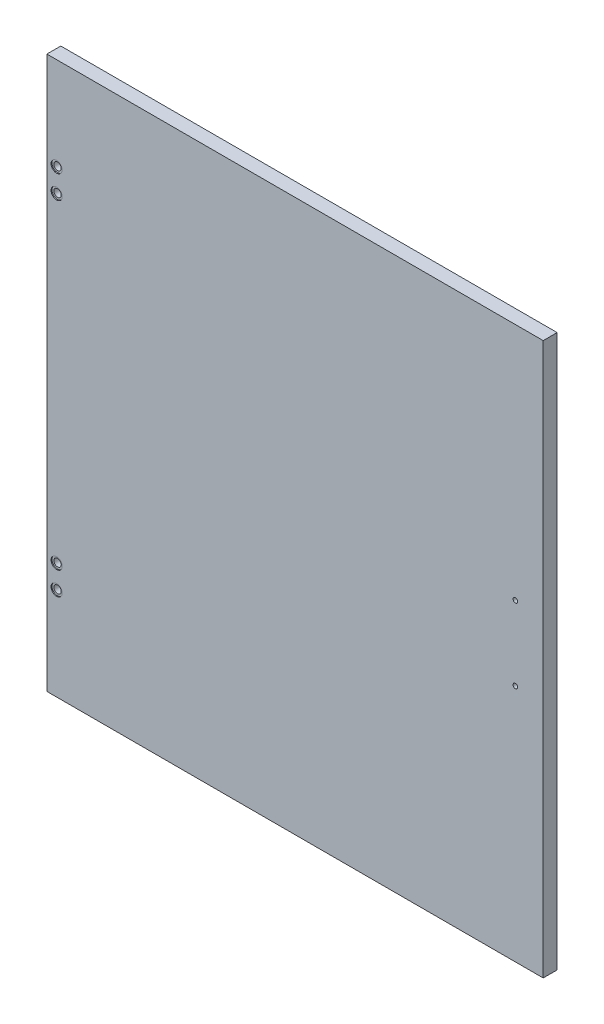
ISO-10303-21;
HEADER;
FILE_DESCRIPTION(('STEP AP214'),'2;1');
FILE_NAME('part.step','',(''),(''),'','','');
FILE_SCHEMA(('AUTOMOTIVE_DESIGN { 1 0 10303 214 1 1 1 1 }'));
ENDSEC;
DATA;
#1=APPLICATION_CONTEXT('core data for automotive mechanical design processes');
#2=APPLICATION_PROTOCOL_DEFINITION('international standard','automotive_design',2000,#1);
#3=PRODUCT_CONTEXT('',#1,'mechanical');
#4=PRODUCT('Part','Part','',(#3));
#5=PRODUCT_RELATED_PRODUCT_CATEGORY('part','',(#4));
#6=PRODUCT_DEFINITION_FORMATION('','',#4);
#7=PRODUCT_DEFINITION_CONTEXT('part definition',#1,'design');
#8=PRODUCT_DEFINITION('design','',#6,#7);
#9=PRODUCT_DEFINITION_SHAPE('','',#8);
#10=(LENGTH_UNIT() NAMED_UNIT(*) SI_UNIT(.MILLI.,.METRE.));
#11=(NAMED_UNIT(*) PLANE_ANGLE_UNIT() SI_UNIT($,.RADIAN.));
#12=(NAMED_UNIT(*) SI_UNIT($,.STERADIAN.) SOLID_ANGLE_UNIT());
#13=UNCERTAINTY_MEASURE_WITH_UNIT(LENGTH_MEASURE(1.E-05),#10,'distance_accuracy_value','');
#14=(GEOMETRIC_REPRESENTATION_CONTEXT(3) GLOBAL_UNCERTAINTY_ASSIGNED_CONTEXT((#13)) GLOBAL_UNIT_ASSIGNED_CONTEXT((#10,
#11,#12)) REPRESENTATION_CONTEXT('',''));
#15=CARTESIAN_POINT('',(0.,0.,0.));
#16=DIRECTION('',(0.,0.,1.));
#17=DIRECTION('',(1.,0.,0.));
#18=AXIS2_PLACEMENT_3D('',#15,#16,#17);
#19=CARTESIAN_POINT('',(-257.,-172.5,0.));
#20=DIRECTION('',(0.,0.,1.));
#21=DIRECTION('',(1.,0.,0.));
#22=AXIS2_PLACEMENT_3D('',#19,#20,#21);
#23=CYLINDRICAL_SURFACE('',#22,3.99999999999999);
#24=CARTESIAN_POINT('',(-257.,-172.5,0.));
#25=DIRECTION('',(0.,0.,-1.));
#26=DIRECTION('',(1.,0.,0.));
#27=AXIS2_PLACEMENT_3D('',#24,#25,#26);
#28=CIRCLE('',#27,3.99999999999999);
#29=CARTESIAN_POINT('',(-253.,-172.5,0.));
#30=VERTEX_POINT('',#29);
#31=EDGE_CURVE('E118',#30,#30,#28,.T.);
#32=ORIENTED_EDGE('',*,*,#31,.T.);
#33=EDGE_LOOP('',(#32));
#34=FACE_BOUND('',#33,.T.);
#35=CARTESIAN_POINT('',(-257.,-172.5,14.));
#36=DIRECTION('',(0.,0.,1.));
#37=DIRECTION('',(1.,0.,0.));
#38=AXIS2_PLACEMENT_3D('',#35,#36,#37);
#39=CIRCLE('',#38,3.99999999999999);
#40=CARTESIAN_POINT('',(-253.,-172.5,14.));
#41=VERTEX_POINT('',#40);
#42=EDGE_CURVE('E40',#41,#41,#39,.T.);
#43=ORIENTED_EDGE('',*,*,#42,.T.);
#44=EDGE_LOOP('',(#43));
#45=FACE_BOUND('',#44,.T.);
#46=ADVANCED_FACE('F36',(#34,#45),#23,.F.);
#47=CARTESIAN_POINT('',(-257.,-197.5,0.));
#48=DIRECTION('',(0.,0.,1.));
#49=DIRECTION('',(1.,0.,0.));
#50=AXIS2_PLACEMENT_3D('',#47,#48,#49);
#51=CYLINDRICAL_SURFACE('',#50,3.99999999999999);
#52=CARTESIAN_POINT('',(-257.,-197.5,0.));
#53=DIRECTION('',(0.,0.,-1.));
#54=DIRECTION('',(1.,0.,0.));
#55=AXIS2_PLACEMENT_3D('',#52,#53,#54);
#56=CIRCLE('',#55,3.99999999999999);
#57=CARTESIAN_POINT('',(-253.,-197.5,0.));
#58=VERTEX_POINT('',#57);
#59=EDGE_CURVE('E154',#58,#58,#56,.T.);
#60=ORIENTED_EDGE('',*,*,#59,.T.);
#61=EDGE_LOOP('',(#60));
#62=FACE_BOUND('',#61,.T.);
#63=CARTESIAN_POINT('',(-257.,-197.5,14.));
#64=DIRECTION('',(0.,0.,1.));
#65=DIRECTION('',(1.,0.,0.));
#66=AXIS2_PLACEMENT_3D('',#63,#64,#65);
#67=CIRCLE('',#66,3.99999999999999);
#68=CARTESIAN_POINT('',(-253.,-197.5,14.));
#69=VERTEX_POINT('',#68);
#70=EDGE_CURVE('E119',#69,#69,#67,.T.);
#71=ORIENTED_EDGE('',*,*,#70,.T.);
#72=EDGE_LOOP('',(#71));
#73=FACE_BOUND('',#72,.T.);
#74=ADVANCED_FACE('F172',(#62,#73),#51,.F.);
#75=CARTESIAN_POINT('',(-257.,172.5,0.));
#76=DIRECTION('',(0.,0.,1.));
#77=DIRECTION('',(1.,0.,0.));
#78=AXIS2_PLACEMENT_3D('',#75,#76,#77);
#79=CYLINDRICAL_SURFACE('',#78,3.99999999999999);
#80=CARTESIAN_POINT('',(-257.,172.5,0.));
#81=DIRECTION('',(0.,0.,1.));
#82=DIRECTION('',(1.,0.,0.));
#83=AXIS2_PLACEMENT_3D('',#80,#81,#82);
#84=CIRCLE('',#83,3.99999999999999);
#85=CARTESIAN_POINT('',(-253.,172.5,0.));
#86=VERTEX_POINT('',#85);
#87=EDGE_CURVE('E157',#86,#86,#84,.T.);
#88=ORIENTED_EDGE('',*,*,#87,.F.);
#89=EDGE_LOOP('',(#88));
#90=FACE_BOUND('',#89,.T.);
#91=CARTESIAN_POINT('',(-257.,172.5,14.));
#92=DIRECTION('',(0.,0.,1.));
#93=DIRECTION('',(1.,0.,0.));
#94=AXIS2_PLACEMENT_3D('',#91,#92,#93);
#95=CIRCLE('',#94,3.99999999999999);
#96=CARTESIAN_POINT('',(-253.,172.5,14.));
#97=VERTEX_POINT('',#96);
#98=EDGE_CURVE('E115',#97,#97,#95,.F.);
#99=ORIENTED_EDGE('',*,*,#98,.F.);
#100=EDGE_LOOP('',(#99));
#101=FACE_BOUND('',#100,.T.);
#102=ADVANCED_FACE('F168',(#90,#101),#79,.F.);
#103=CARTESIAN_POINT('',(-257.,197.5,0.));
#104=DIRECTION('',(0.,0.,1.));
#105=DIRECTION('',(1.,0.,0.));
#106=AXIS2_PLACEMENT_3D('',#103,#104,#105);
#107=CYLINDRICAL_SURFACE('',#106,3.99999999999999);
#108=CARTESIAN_POINT('',(-257.,197.5,0.));
#109=DIRECTION('',(0.,0.,1.));
#110=DIRECTION('',(1.,0.,0.));
#111=AXIS2_PLACEMENT_3D('',#108,#109,#110);
#112=CIRCLE('',#111,3.99999999999999);
#113=CARTESIAN_POINT('',(-253.,197.5,0.));
#114=VERTEX_POINT('',#113);
#115=EDGE_CURVE('E106',#114,#114,#112,.T.);
#116=ORIENTED_EDGE('',*,*,#115,.F.);
#117=EDGE_LOOP('',(#116));
#118=FACE_BOUND('',#117,.T.);
#119=CARTESIAN_POINT('',(-257.,197.5,14.));
#120=DIRECTION('',(0.,0.,1.));
#121=DIRECTION('',(1.,0.,0.));
#122=AXIS2_PLACEMENT_3D('',#119,#120,#121);
#123=CIRCLE('',#122,3.99999999999999);
#124=CARTESIAN_POINT('',(-253.,197.5,14.));
#125=VERTEX_POINT('',#124);
#126=EDGE_CURVE('E112',#125,#125,#123,.F.);
#127=ORIENTED_EDGE('',*,*,#126,.F.);
#128=EDGE_LOOP('',(#127));
#129=FACE_BOUND('',#128,.T.);
#130=ADVANCED_FACE('F171',(#118,#129),#107,.F.);
#131=CARTESIAN_POINT('',(267.5,297.5,15.));
#132=DIRECTION('',(-1.,0.,0.));
#133=DIRECTION('',(0.,-1.,0.));
#134=AXIS2_PLACEMENT_3D('',#131,#132,#133);
#135=PLANE('',#134);
#136=DIRECTION('',(0.,1.,0.));
#137=VECTOR('',#136,1.);
#138=CARTESIAN_POINT('',(267.5,297.5,0.));
#139=LINE('',#138,#137);
#140=CARTESIAN_POINT('',(267.5,-297.5,0.));
#141=VERTEX_POINT('',#140);
#142=CARTESIAN_POINT('',(267.5,297.5,0.));
#143=VERTEX_POINT('',#142);
#144=EDGE_CURVE('E103',#141,#143,#139,.T.);
#145=ORIENTED_EDGE('',*,*,#144,.T.);
#146=DIRECTION('',(0.,0.,-1.));
#147=VECTOR('',#146,1.);
#148=CARTESIAN_POINT('',(267.5,297.5,15.));
#149=LINE('',#148,#147);
#150=CARTESIAN_POINT('',(267.5,297.5,15.));
#151=VERTEX_POINT('',#150);
#152=EDGE_CURVE('E11',#151,#143,#149,.T.);
#153=ORIENTED_EDGE('',*,*,#152,.F.);
#154=DIRECTION('',(0.,1.,0.));
#155=VECTOR('',#154,1.);
#156=CARTESIAN_POINT('',(267.5,297.5,15.));
#157=LINE('',#156,#155);
#158=CARTESIAN_POINT('',(267.5,-297.5,15.));
#159=VERTEX_POINT('',#158);
#160=EDGE_CURVE('E90',#159,#151,#157,.T.);
#161=ORIENTED_EDGE('',*,*,#160,.F.);
#162=DIRECTION('',(0.,0.,-1.));
#163=VECTOR('',#162,1.);
#164=CARTESIAN_POINT('',(267.5,-297.5,15.));
#165=LINE('',#164,#163);
#166=EDGE_CURVE('E99',#159,#141,#165,.T.);
#167=ORIENTED_EDGE('',*,*,#166,.T.);
#168=EDGE_LOOP('',(#145,#153,#161,#167));
#169=FACE_BOUND('',#168,.T.);
#170=ADVANCED_FACE('F38',(#169),#135,.F.);
#171=CARTESIAN_POINT('',(-267.5,297.5,15.));
#172=DIRECTION('',(0.,-1.,0.));
#173=DIRECTION('',(0.,0.,-1.));
#174=AXIS2_PLACEMENT_3D('',#171,#172,#173);
#175=PLANE('',#174);
#176=DIRECTION('',(-1.,0.,0.));
#177=VECTOR('',#176,1.);
#178=CARTESIAN_POINT('',(-267.5,297.5,0.));
#179=LINE('',#178,#177);
#180=CARTESIAN_POINT('',(-267.5,297.5,0.));
#181=VERTEX_POINT('',#180);
#182=EDGE_CURVE('E94',#143,#181,#179,.T.);
#183=ORIENTED_EDGE('',*,*,#182,.T.);
#184=DIRECTION('',(0.,0.,-1.));
#185=VECTOR('',#184,1.);
#186=CARTESIAN_POINT('',(-267.5,297.5,15.));
#187=LINE('',#186,#185);
#188=CARTESIAN_POINT('',(-267.5,297.5,15.));
#189=VERTEX_POINT('',#188);
#190=EDGE_CURVE('E46',#189,#181,#187,.T.);
#191=ORIENTED_EDGE('',*,*,#190,.F.);
#192=DIRECTION('',(-1.,0.,0.));
#193=VECTOR('',#192,1.);
#194=CARTESIAN_POINT('',(-267.5,297.5,15.));
#195=LINE('',#194,#193);
#196=EDGE_CURVE('E85',#151,#189,#195,.T.);
#197=ORIENTED_EDGE('',*,*,#196,.F.);
#198=ORIENTED_EDGE('',*,*,#152,.T.);
#199=EDGE_LOOP('',(#183,#191,#197,#198));
#200=FACE_BOUND('',#199,.T.);
#201=ADVANCED_FACE('F93',(#200),#175,.F.);
#202=CARTESIAN_POINT('',(-267.5,297.5,15.));
#203=DIRECTION('',(1.,0.,0.));
#204=DIRECTION('',(0.,1.,0.));
#205=AXIS2_PLACEMENT_3D('',#202,#203,#204);
#206=PLANE('',#205);
#207=DIRECTION('',(0.,-1.,0.));
#208=VECTOR('',#207,1.);
#209=CARTESIAN_POINT('',(-267.5,297.5,0.));
#210=LINE('',#209,#208);
#211=CARTESIAN_POINT('',(-267.5,-297.5,0.));
#212=VERTEX_POINT('',#211);
#213=EDGE_CURVE('E72',#181,#212,#210,.T.);
#214=ORIENTED_EDGE('',*,*,#213,.T.);
#215=DIRECTION('',(0.,0.,-1.));
#216=VECTOR('',#215,1.);
#217=CARTESIAN_POINT('',(-267.5,-297.5,15.));
#218=LINE('',#217,#216);
#219=CARTESIAN_POINT('',(-267.5,-297.5,15.));
#220=VERTEX_POINT('',#219);
#221=EDGE_CURVE('E95',#220,#212,#218,.T.);
#222=ORIENTED_EDGE('',*,*,#221,.F.);
#223=DIRECTION('',(0.,-1.,0.));
#224=VECTOR('',#223,1.);
#225=CARTESIAN_POINT('',(-267.5,297.5,15.));
#226=LINE('',#225,#224);
#227=EDGE_CURVE('E88',#189,#220,#226,.T.);
#228=ORIENTED_EDGE('',*,*,#227,.F.);
#229=ORIENTED_EDGE('',*,*,#190,.T.);
#230=EDGE_LOOP('',(#214,#222,#228,#229));
#231=FACE_BOUND('',#230,.T.);
#232=ADVANCED_FACE('F97',(#231),#206,.F.);
#233=CARTESIAN_POINT('',(-267.5,-297.5,15.));
#234=DIRECTION('',(0.,1.,0.));
#235=DIRECTION('',(0.,0.,1.));
#236=AXIS2_PLACEMENT_3D('',#233,#234,#235);
#237=PLANE('',#236);
#238=DIRECTION('',(1.,0.,0.));
#239=VECTOR('',#238,1.);
#240=CARTESIAN_POINT('',(-267.5,-297.5,0.));
#241=LINE('',#240,#239);
#242=EDGE_CURVE('E78',#212,#141,#241,.T.);
#243=ORIENTED_EDGE('',*,*,#242,.T.);
#244=ORIENTED_EDGE('',*,*,#166,.F.);
#245=DIRECTION('',(1.,0.,0.));
#246=VECTOR('',#245,1.);
#247=CARTESIAN_POINT('',(-267.5,-297.5,15.));
#248=LINE('',#247,#246);
#249=EDGE_CURVE('E55',#220,#159,#248,.T.);
#250=ORIENTED_EDGE('',*,*,#249,.F.);
#251=ORIENTED_EDGE('',*,*,#221,.T.);
#252=EDGE_LOOP('',(#243,#244,#250,#251));
#253=FACE_BOUND('',#252,.T.);
#254=ADVANCED_FACE('F207',(#253),#237,.F.);
#255=CARTESIAN_POINT('',(0.,0.,15.));
#256=DIRECTION('',(0.,0.,1.));
#257=DIRECTION('',(1.,0.,0.));
#258=AXIS2_PLACEMENT_3D('',#255,#256,#257);
#259=PLANE('',#258);
#260=CARTESIAN_POINT('',(237.5,40.,15.));
#261=DIRECTION('',(0.,0.,1.));
#262=DIRECTION('',(1.,0.,0.));
#263=AXIS2_PLACEMENT_3D('',#260,#261,#262);
#264=CIRCLE('',#263,2.5);
#265=CARTESIAN_POINT('',(240.,40.,15.));
#266=VERTEX_POINT('',#265);
#267=EDGE_CURVE('E534',#266,#266,#264,.T.);
#268=ORIENTED_EDGE('',*,*,#267,.F.);
#269=EDGE_LOOP('',(#268));
#270=FACE_BOUND('',#269,.T.);
#271=CARTESIAN_POINT('',(237.5,-40.,15.));
#272=DIRECTION('',(0.,0.,1.));
#273=DIRECTION('',(1.,0.,0.));
#274=AXIS2_PLACEMENT_3D('',#271,#272,#273);
#275=CIRCLE('',#274,2.5);
#276=CARTESIAN_POINT('',(240.,-40.,15.));
#277=VERTEX_POINT('',#276);
#278=EDGE_CURVE('E536',#277,#277,#275,.T.);
#279=ORIENTED_EDGE('',*,*,#278,.F.);
#280=EDGE_LOOP('',(#279));
#281=FACE_BOUND('',#280,.T.);
#282=CARTESIAN_POINT('',(-257.,-197.5,15.));
#283=DIRECTION('',(0.,0.,-1.));
#284=DIRECTION('',(1.,0.,0.));
#285=AXIS2_PLACEMENT_3D('',#282,#283,#284);
#286=CIRCLE('',#285,5.99999999999999);
#287=CARTESIAN_POINT('',(-251.,-197.5,15.));
#288=VERTEX_POINT('',#287);
#289=EDGE_CURVE('E127',#288,#288,#286,.T.);
#290=ORIENTED_EDGE('',*,*,#289,.T.);
#291=EDGE_LOOP('',(#290));
#292=FACE_BOUND('',#291,.T.);
#293=CARTESIAN_POINT('',(-257.,-172.5,15.));
#294=DIRECTION('',(0.,0.,-1.));
#295=DIRECTION('',(1.,0.,0.));
#296=AXIS2_PLACEMENT_3D('',#293,#294,#295);
#297=CIRCLE('',#296,5.99999999999999);
#298=CARTESIAN_POINT('',(-251.,-172.5,15.));
#299=VERTEX_POINT('',#298);
#300=EDGE_CURVE('E140',#299,#299,#297,.T.);
#301=ORIENTED_EDGE('',*,*,#300,.T.);
#302=EDGE_LOOP('',(#301));
#303=FACE_BOUND('',#302,.T.);
#304=CARTESIAN_POINT('',(-257.,197.5,15.));
#305=DIRECTION('',(0.,0.,1.));
#306=DIRECTION('',(1.,0.,0.));
#307=AXIS2_PLACEMENT_3D('',#304,#305,#306);
#308=CIRCLE('',#307,5.99999999999999);
#309=CARTESIAN_POINT('',(-251.,197.5,15.));
#310=VERTEX_POINT('',#309);
#311=EDGE_CURVE('E146',#310,#310,#308,.T.);
#312=ORIENTED_EDGE('',*,*,#311,.F.);
#313=EDGE_LOOP('',(#312));
#314=FACE_BOUND('',#313,.T.);
#315=CARTESIAN_POINT('',(-257.,172.5,15.));
#316=DIRECTION('',(0.,0.,1.));
#317=DIRECTION('',(1.,0.,0.));
#318=AXIS2_PLACEMENT_3D('',#315,#316,#317);
#319=CIRCLE('',#318,5.99999999999999);
#320=CARTESIAN_POINT('',(-251.,172.5,15.));
#321=VERTEX_POINT('',#320);
#322=EDGE_CURVE('E149',#321,#321,#319,.T.);
#323=ORIENTED_EDGE('',*,*,#322,.F.);
#324=EDGE_LOOP('',(#323));
#325=FACE_BOUND('',#324,.T.);
#326=ORIENTED_EDGE('',*,*,#160,.T.);
#327=ORIENTED_EDGE('',*,*,#196,.T.);
#328=ORIENTED_EDGE('',*,*,#227,.T.);
#329=ORIENTED_EDGE('',*,*,#249,.T.);
#330=EDGE_LOOP('',(#326,#327,#328,#329));
#331=FACE_BOUND('',#330,.T.);
#332=ADVANCED_FACE('F86',(#270,#281,#292,#303,#314,#325,#331),#259,.T.);
#333=CARTESIAN_POINT('',(0.,0.,0.));
#334=DIRECTION('',(0.,0.,1.));
#335=DIRECTION('',(1.,0.,0.));
#336=AXIS2_PLACEMENT_3D('',#333,#334,#335);
#337=PLANE('',#336);
#338=CARTESIAN_POINT('',(260.,-188.5,0.));
#339=DIRECTION('',(0.,0.,1.));
#340=DIRECTION('',(-1.,0.,0.));
#341=AXIS2_PLACEMENT_3D('',#338,#339,#340);
#342=CIRCLE('',#341,2.);
#343=CARTESIAN_POINT('',(258.,-188.5,0.));
#344=VERTEX_POINT('',#343);
#345=EDGE_CURVE('E510',#344,#344,#342,.T.);
#346=ORIENTED_EDGE('',*,*,#345,.T.);
#347=EDGE_LOOP('',(#346));
#348=FACE_BOUND('',#347,.T.);
#349=CARTESIAN_POINT('',(260.,-176.5,0.));
#350=DIRECTION('',(0.,0.,1.));
#351=DIRECTION('',(-1.,0.,0.));
#352=AXIS2_PLACEMENT_3D('',#349,#350,#351);
#353=CIRCLE('',#352,2.);
#354=CARTESIAN_POINT('',(258.,-176.5,0.));
#355=VERTEX_POINT('',#354);
#356=EDGE_CURVE('E521',#355,#355,#353,.T.);
#357=ORIENTED_EDGE('',*,*,#356,.T.);
#358=EDGE_LOOP('',(#357));
#359=FACE_BOUND('',#358,.T.);
#360=CARTESIAN_POINT('',(260.,188.5,0.));
#361=DIRECTION('',(0.,0.,-1.));
#362=DIRECTION('',(-1.,0.,0.));
#363=AXIS2_PLACEMENT_3D('',#360,#361,#362);
#364=CIRCLE('',#363,2.);
#365=CARTESIAN_POINT('',(258.,188.5,0.));
#366=VERTEX_POINT('',#365);
#367=EDGE_CURVE('E527',#366,#366,#364,.T.);
#368=ORIENTED_EDGE('',*,*,#367,.F.);
#369=EDGE_LOOP('',(#368));
#370=FACE_BOUND('',#369,.T.);
#371=CARTESIAN_POINT('',(260.,176.5,0.));
#372=DIRECTION('',(0.,0.,-1.));
#373=DIRECTION('',(-1.,0.,0.));
#374=AXIS2_PLACEMENT_3D('',#371,#372,#373);
#375=CIRCLE('',#374,2.);
#376=CARTESIAN_POINT('',(258.,176.5,0.));
#377=VERTEX_POINT('',#376);
#378=EDGE_CURVE('E513',#377,#377,#375,.T.);
#379=ORIENTED_EDGE('',*,*,#378,.F.);
#380=EDGE_LOOP('',(#379));
#381=FACE_BOUND('',#380,.T.);
#382=CARTESIAN_POINT('',(237.5,40.,0.));
#383=DIRECTION('',(0.,0.,1.));
#384=DIRECTION('',(1.,0.,0.));
#385=AXIS2_PLACEMENT_3D('',#382,#383,#384);
#386=CIRCLE('',#385,2.5);
#387=CARTESIAN_POINT('',(240.,40.,0.));
#388=VERTEX_POINT('',#387);
#389=EDGE_CURVE('E143',#388,#388,#386,.T.);
#390=ORIENTED_EDGE('',*,*,#389,.T.);
#391=EDGE_LOOP('',(#390));
#392=FACE_BOUND('',#391,.T.);
#393=CARTESIAN_POINT('',(237.5,-40.,0.));
#394=DIRECTION('',(0.,0.,1.));
#395=DIRECTION('',(1.,0.,0.));
#396=AXIS2_PLACEMENT_3D('',#393,#394,#395);
#397=CIRCLE('',#396,2.5);
#398=CARTESIAN_POINT('',(240.,-40.,0.));
#399=VERTEX_POINT('',#398);
#400=EDGE_CURVE('E135',#399,#399,#397,.T.);
#401=ORIENTED_EDGE('',*,*,#400,.T.);
#402=EDGE_LOOP('',(#401));
#403=FACE_BOUND('',#402,.T.);
#404=ORIENTED_EDGE('',*,*,#59,.F.);
#405=EDGE_LOOP('',(#404));
#406=FACE_BOUND('',#405,.T.);
#407=ORIENTED_EDGE('',*,*,#31,.F.);
#408=EDGE_LOOP('',(#407));
#409=FACE_BOUND('',#408,.T.);
#410=ORIENTED_EDGE('',*,*,#115,.T.);
#411=EDGE_LOOP('',(#410));
#412=FACE_BOUND('',#411,.T.);
#413=ORIENTED_EDGE('',*,*,#87,.T.);
#414=EDGE_LOOP('',(#413));
#415=FACE_BOUND('',#414,.T.);
#416=ORIENTED_EDGE('',*,*,#144,.F.);
#417=ORIENTED_EDGE('',*,*,#242,.F.);
#418=ORIENTED_EDGE('',*,*,#213,.F.);
#419=ORIENTED_EDGE('',*,*,#182,.F.);
#420=EDGE_LOOP('',(#416,#417,#418,#419));
#421=FACE_BOUND('',#420,.T.);
#422=ADVANCED_FACE('F165',(#348,#359,#370,#381,#392,#403,#406,#409,#412,#415,#421),#337,.F.);
#423=CARTESIAN_POINT('',(-257.,197.5,14.));
#424=DIRECTION('',(0.,0.,1.));
#425=DIRECTION('',(1.,0.,0.));
#426=AXIS2_PLACEMENT_3D('',#423,#424,#425);
#427=PLANE('',#426);
#428=CARTESIAN_POINT('',(-257.,197.5,14.));
#429=DIRECTION('',(0.,0.,1.));
#430=DIRECTION('',(1.,0.,0.));
#431=AXIS2_PLACEMENT_3D('',#428,#429,#430);
#432=CIRCLE('',#431,5.99999999999999);
#433=CARTESIAN_POINT('',(-251.,197.5,14.));
#434=VERTEX_POINT('',#433);
#435=EDGE_CURVE('E116',#434,#434,#432,.T.);
#436=ORIENTED_EDGE('',*,*,#435,.T.);
#437=EDGE_LOOP('',(#436));
#438=FACE_BOUND('',#437,.T.);
#439=ORIENTED_EDGE('',*,*,#126,.T.);
#440=EDGE_LOOP('',(#439));
#441=FACE_BOUND('',#440,.T.);
#442=ADVANCED_FACE('F189',(#438,#441),#427,.T.);
#443=CARTESIAN_POINT('',(-257.,197.5,14.));
#444=DIRECTION('',(0.,0.,1.));
#445=DIRECTION('',(1.,0.,0.));
#446=AXIS2_PLACEMENT_3D('',#443,#444,#445);
#447=CYLINDRICAL_SURFACE('',#446,5.99999999999999);
#448=ORIENTED_EDGE('',*,*,#435,.F.);
#449=EDGE_LOOP('',(#448));
#450=FACE_BOUND('',#449,.T.);
#451=ORIENTED_EDGE('',*,*,#311,.T.);
#452=EDGE_LOOP('',(#451));
#453=FACE_BOUND('',#452,.T.);
#454=ADVANCED_FACE('F179',(#450,#453),#447,.F.);
#455=CARTESIAN_POINT('',(-257.,172.5,14.));
#456=DIRECTION('',(0.,0.,1.));
#457=DIRECTION('',(1.,0.,0.));
#458=AXIS2_PLACEMENT_3D('',#455,#456,#457);
#459=PLANE('',#458);
#460=CARTESIAN_POINT('',(-257.,172.5,14.));
#461=DIRECTION('',(0.,0.,1.));
#462=DIRECTION('',(1.,0.,0.));
#463=AXIS2_PLACEMENT_3D('',#460,#461,#462);
#464=CIRCLE('',#463,5.99999999999999);
#465=CARTESIAN_POINT('',(-251.,172.5,14.));
#466=VERTEX_POINT('',#465);
#467=EDGE_CURVE('E125',#466,#466,#464,.T.);
#468=ORIENTED_EDGE('',*,*,#467,.T.);
#469=EDGE_LOOP('',(#468));
#470=FACE_BOUND('',#469,.T.);
#471=ORIENTED_EDGE('',*,*,#98,.T.);
#472=EDGE_LOOP('',(#471));
#473=FACE_BOUND('',#472,.T.);
#474=ADVANCED_FACE('F176',(#470,#473),#459,.T.);
#475=CARTESIAN_POINT('',(-257.,172.5,14.));
#476=DIRECTION('',(0.,0.,1.));
#477=DIRECTION('',(1.,0.,0.));
#478=AXIS2_PLACEMENT_3D('',#475,#476,#477);
#479=CYLINDRICAL_SURFACE('',#478,5.99999999999999);
#480=ORIENTED_EDGE('',*,*,#467,.F.);
#481=EDGE_LOOP('',(#480));
#482=FACE_BOUND('',#481,.T.);
#483=ORIENTED_EDGE('',*,*,#322,.T.);
#484=EDGE_LOOP('',(#483));
#485=FACE_BOUND('',#484,.T.);
#486=ADVANCED_FACE('F178',(#482,#485),#479,.F.);
#487=CARTESIAN_POINT('',(-257.,-197.5,14.));
#488=DIRECTION('',(0.,0.,1.));
#489=DIRECTION('',(1.,0.,0.));
#490=AXIS2_PLACEMENT_3D('',#487,#488,#489);
#491=CYLINDRICAL_SURFACE('',#490,5.99999999999999);
#492=CARTESIAN_POINT('',(-257.,-197.5,14.));
#493=DIRECTION('',(0.,0.,-1.));
#494=DIRECTION('',(1.,0.,0.));
#495=AXIS2_PLACEMENT_3D('',#492,#493,#494);
#496=CIRCLE('',#495,5.99999999999999);
#497=CARTESIAN_POINT('',(-251.,-197.5,14.));
#498=VERTEX_POINT('',#497);
#499=EDGE_CURVE('E121',#498,#498,#496,.T.);
#500=ORIENTED_EDGE('',*,*,#499,.T.);
#501=EDGE_LOOP('',(#500));
#502=FACE_BOUND('',#501,.T.);
#503=ORIENTED_EDGE('',*,*,#289,.F.);
#504=EDGE_LOOP('',(#503));
#505=FACE_BOUND('',#504,.T.);
#506=ADVANCED_FACE('F186',(#502,#505),#491,.F.);
#507=CARTESIAN_POINT('',(-257.,-197.5,14.));
#508=DIRECTION('',(0.,0.,1.));
#509=DIRECTION('',(1.,0.,0.));
#510=AXIS2_PLACEMENT_3D('',#507,#508,#509);
#511=PLANE('',#510);
#512=ORIENTED_EDGE('',*,*,#70,.F.);
#513=EDGE_LOOP('',(#512));
#514=FACE_BOUND('',#513,.T.);
#515=ORIENTED_EDGE('',*,*,#499,.F.);
#516=EDGE_LOOP('',(#515));
#517=FACE_BOUND('',#516,.T.);
#518=ADVANCED_FACE('F250',(#514,#517),#511,.T.);
#519=CARTESIAN_POINT('',(-257.,-172.5,14.));
#520=DIRECTION('',(0.,0.,1.));
#521=DIRECTION('',(1.,0.,0.));
#522=AXIS2_PLACEMENT_3D('',#519,#520,#521);
#523=CYLINDRICAL_SURFACE('',#522,5.99999999999999);
#524=CARTESIAN_POINT('',(-257.,-172.5,14.));
#525=DIRECTION('',(0.,0.,-1.));
#526=DIRECTION('',(1.,0.,0.));
#527=AXIS2_PLACEMENT_3D('',#524,#525,#526);
#528=CIRCLE('',#527,5.99999999999999);
#529=CARTESIAN_POINT('',(-251.,-172.5,14.));
#530=VERTEX_POINT('',#529);
#531=EDGE_CURVE('E132',#530,#530,#528,.T.);
#532=ORIENTED_EDGE('',*,*,#531,.T.);
#533=EDGE_LOOP('',(#532));
#534=FACE_BOUND('',#533,.T.);
#535=ORIENTED_EDGE('',*,*,#300,.F.);
#536=EDGE_LOOP('',(#535));
#537=FACE_BOUND('',#536,.T.);
#538=ADVANCED_FACE('F261',(#534,#537),#523,.F.);
#539=CARTESIAN_POINT('',(-257.,-172.5,14.));
#540=DIRECTION('',(0.,0.,1.));
#541=DIRECTION('',(1.,0.,0.));
#542=AXIS2_PLACEMENT_3D('',#539,#540,#541);
#543=PLANE('',#542);
#544=ORIENTED_EDGE('',*,*,#42,.F.);
#545=EDGE_LOOP('',(#544));
#546=FACE_BOUND('',#545,.T.);
#547=ORIENTED_EDGE('',*,*,#531,.F.);
#548=EDGE_LOOP('',(#547));
#549=FACE_BOUND('',#548,.T.);
#550=ADVANCED_FACE('F272',(#546,#549),#543,.T.);
#551=CARTESIAN_POINT('',(237.5,-40.,0.));
#552=DIRECTION('',(0.,0.,1.));
#553=DIRECTION('',(1.,0.,0.));
#554=AXIS2_PLACEMENT_3D('',#551,#552,#553);
#555=CYLINDRICAL_SURFACE('',#554,2.5);
#556=ORIENTED_EDGE('',*,*,#400,.F.);
#557=EDGE_LOOP('',(#556));
#558=FACE_BOUND('',#557,.T.);
#559=ORIENTED_EDGE('',*,*,#278,.T.);
#560=EDGE_LOOP('',(#559));
#561=FACE_BOUND('',#560,.T.);
#562=ADVANCED_FACE('F283',(#558,#561),#555,.F.);
#563=CARTESIAN_POINT('',(237.5,40.,0.));
#564=DIRECTION('',(0.,0.,1.));
#565=DIRECTION('',(1.,0.,0.));
#566=AXIS2_PLACEMENT_3D('',#563,#564,#565);
#567=CYLINDRICAL_SURFACE('',#566,2.5);
#568=ORIENTED_EDGE('',*,*,#389,.F.);
#569=EDGE_LOOP('',(#568));
#570=FACE_BOUND('',#569,.T.);
#571=ORIENTED_EDGE('',*,*,#267,.T.);
#572=EDGE_LOOP('',(#571));
#573=FACE_BOUND('',#572,.T.);
#574=ADVANCED_FACE('F304',(#570,#573),#567,.F.);
#575=CARTESIAN_POINT('',(260.,176.5,9.));
#576=DIRECTION('',(0.,0.,-1.));
#577=DIRECTION('',(-1.,0.,0.));
#578=AXIS2_PLACEMENT_3D('',#575,#576,#577);
#579=CYLINDRICAL_SURFACE('',#578,2.);
#580=CARTESIAN_POINT('',(260.,176.5,9.));
#581=DIRECTION('',(0.,0.,-1.));
#582=DIRECTION('',(-1.,0.,0.));
#583=AXIS2_PLACEMENT_3D('',#580,#581,#582);
#584=CIRCLE('',#583,2.);
#585=CARTESIAN_POINT('',(258.,176.5,9.));
#586=VERTEX_POINT('',#585);
#587=EDGE_CURVE('E509',#586,#586,#584,.T.);
#588=ORIENTED_EDGE('',*,*,#587,.F.);
#589=EDGE_LOOP('',(#588));
#590=FACE_BOUND('',#589,.T.);
#591=ORIENTED_EDGE('',*,*,#378,.T.);
#592=EDGE_LOOP('',(#591));
#593=FACE_BOUND('',#592,.T.);
#594=ADVANCED_FACE('F315',(#590,#593),#579,.F.);
#595=CARTESIAN_POINT('',(260.,176.5,9.));
#596=DIRECTION('',(0.,0.,-1.));
#597=DIRECTION('',(-1.,0.,0.));
#598=AXIS2_PLACEMENT_3D('',#595,#596,#597);
#599=PLANE('',#598);
#600=ORIENTED_EDGE('',*,*,#587,.T.);
#601=EDGE_LOOP('',(#600));
#602=FACE_BOUND('',#601,.T.);
#603=ADVANCED_FACE('F326',(#602),#599,.T.);
#604=CARTESIAN_POINT('',(260.,188.5,9.));
#605=DIRECTION('',(0.,0.,-1.));
#606=DIRECTION('',(-1.,0.,0.));
#607=AXIS2_PLACEMENT_3D('',#604,#605,#606);
#608=CYLINDRICAL_SURFACE('',#607,2.);
#609=CARTESIAN_POINT('',(260.,188.5,9.));
#610=DIRECTION('',(0.,0.,-1.));
#611=DIRECTION('',(-1.,0.,0.));
#612=AXIS2_PLACEMENT_3D('',#609,#610,#611);
#613=CIRCLE('',#612,2.);
#614=CARTESIAN_POINT('',(258.,188.5,9.));
#615=VERTEX_POINT('',#614);
#616=EDGE_CURVE('E524',#615,#615,#613,.T.);
#617=ORIENTED_EDGE('',*,*,#616,.F.);
#618=EDGE_LOOP('',(#617));
#619=FACE_BOUND('',#618,.T.);
#620=ORIENTED_EDGE('',*,*,#367,.T.);
#621=EDGE_LOOP('',(#620));
#622=FACE_BOUND('',#621,.T.);
#623=ADVANCED_FACE('F337',(#619,#622),#608,.F.);
#624=CARTESIAN_POINT('',(260.,188.5,9.));
#625=DIRECTION('',(0.,0.,-1.));
#626=DIRECTION('',(-1.,0.,0.));
#627=AXIS2_PLACEMENT_3D('',#624,#625,#626);
#628=PLANE('',#627);
#629=ORIENTED_EDGE('',*,*,#616,.T.);
#630=EDGE_LOOP('',(#629));
#631=FACE_BOUND('',#630,.T.);
#632=ADVANCED_FACE('F348',(#631),#628,.T.);
#633=CARTESIAN_POINT('',(260.,-176.5,9.));
#634=DIRECTION('',(0.,0.,-1.));
#635=DIRECTION('',(-1.,0.,0.));
#636=AXIS2_PLACEMENT_3D('',#633,#634,#635);
#637=CYLINDRICAL_SURFACE('',#636,2.);
#638=CARTESIAN_POINT('',(260.,-176.5,9.));
#639=DIRECTION('',(0.,0.,1.));
#640=DIRECTION('',(-1.,0.,0.));
#641=AXIS2_PLACEMENT_3D('',#638,#639,#640);
#642=CIRCLE('',#641,2.);
#643=CARTESIAN_POINT('',(258.,-176.5,9.));
#644=VERTEX_POINT('',#643);
#645=EDGE_CURVE('E516',#644,#644,#642,.T.);
#646=ORIENTED_EDGE('',*,*,#645,.T.);
#647=EDGE_LOOP('',(#646));
#648=FACE_BOUND('',#647,.T.);
#649=ORIENTED_EDGE('',*,*,#356,.F.);
#650=EDGE_LOOP('',(#649));
#651=FACE_BOUND('',#650,.T.);
#652=ADVANCED_FACE('F358',(#648,#651),#637,.F.);
#653=CARTESIAN_POINT('',(260.,-176.5,9.));
#654=DIRECTION('',(0.,0.,-1.));
#655=DIRECTION('',(-1.,0.,0.));
#656=AXIS2_PLACEMENT_3D('',#653,#654,#655);
#657=PLANE('',#656);
#658=ORIENTED_EDGE('',*,*,#645,.F.);
#659=EDGE_LOOP('',(#658));
#660=FACE_BOUND('',#659,.T.);
#661=ADVANCED_FACE('F373',(#660),#657,.T.);
#662=CARTESIAN_POINT('',(260.,-188.5,9.));
#663=DIRECTION('',(0.,0.,-1.));
#664=DIRECTION('',(-1.,0.,0.));
#665=AXIS2_PLACEMENT_3D('',#662,#663,#664);
#666=CYLINDRICAL_SURFACE('',#665,2.);
#667=CARTESIAN_POINT('',(260.,-188.5,9.));
#668=DIRECTION('',(0.,0.,1.));
#669=DIRECTION('',(-1.,0.,0.));
#670=AXIS2_PLACEMENT_3D('',#667,#668,#669);
#671=CIRCLE('',#670,2.);
#672=CARTESIAN_POINT('',(258.,-188.5,9.));
#673=VERTEX_POINT('',#672);
#674=EDGE_CURVE('E508',#673,#673,#671,.T.);
#675=ORIENTED_EDGE('',*,*,#674,.T.);
#676=EDGE_LOOP('',(#675));
#677=FACE_BOUND('',#676,.T.);
#678=ORIENTED_EDGE('',*,*,#345,.F.);
#679=EDGE_LOOP('',(#678));
#680=FACE_BOUND('',#679,.T.);
#681=ADVANCED_FACE('F384',(#677,#680),#666,.F.);
#682=CARTESIAN_POINT('',(260.,-188.5,9.));
#683=DIRECTION('',(0.,0.,-1.));
#684=DIRECTION('',(-1.,0.,0.));
#685=AXIS2_PLACEMENT_3D('',#682,#683,#684);
#686=PLANE('',#685);
#687=ORIENTED_EDGE('',*,*,#674,.F.);
#688=EDGE_LOOP('',(#687));
#689=FACE_BOUND('',#688,.T.);
#690=ADVANCED_FACE('F395',(#689),#686,.T.);
#691=CLOSED_SHELL('',(#46,#74,#102,#130,#170,#201,#232,#254,#332,#422,#442,#454,#474,#486,#506,
#518,#538,#550,#562,#574,#594,#603,#623,#632,#652,#661,#681,#690));
#692=MANIFOLD_SOLID_BREP('B2',#691);
#693=ADVANCED_BREP_SHAPE_REPRESENTATION('',(#18,#692),#14);
#694=SHAPE_DEFINITION_REPRESENTATION(#9,#693);
ENDSEC;
END-ISO-10303-21;
